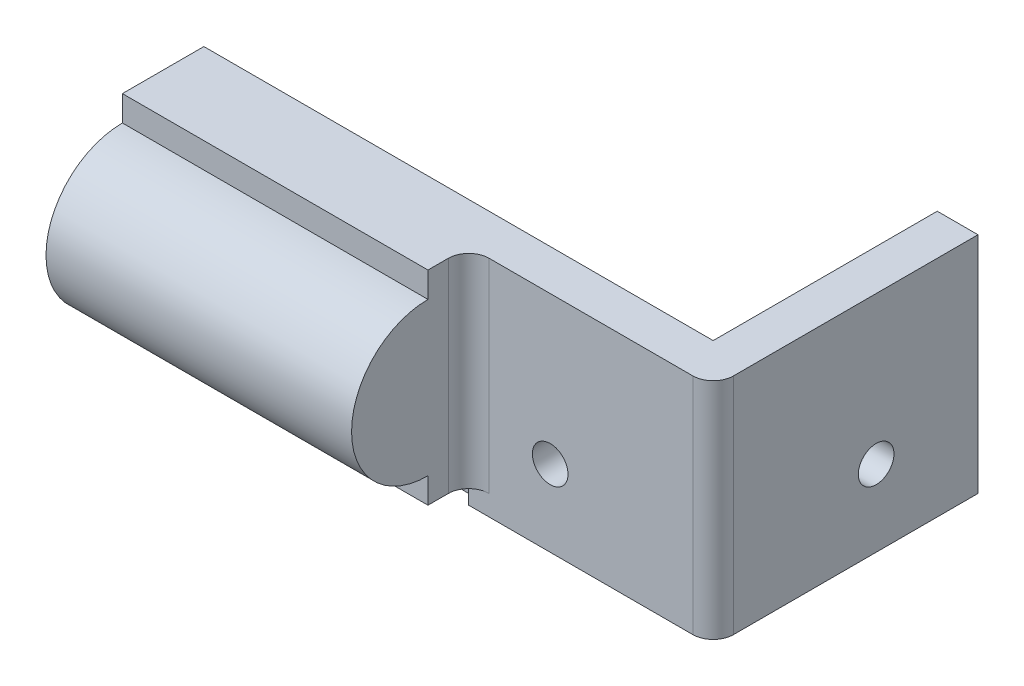
ISO-10303-21;
HEADER;
FILE_DESCRIPTION(('STEP AP214'),'2;1');
FILE_NAME('part.step','',(''),(''),'','','');
FILE_SCHEMA(('AUTOMOTIVE_DESIGN { 1 0 10303 214 1 1 1 1 }'));
ENDSEC;
DATA;
#1=APPLICATION_CONTEXT('core data for automotive mechanical design processes');
#2=APPLICATION_PROTOCOL_DEFINITION('international standard','automotive_design',2000,#1);
#3=PRODUCT_CONTEXT('',#1,'mechanical');
#4=PRODUCT('Part','Part','',(#3));
#5=PRODUCT_RELATED_PRODUCT_CATEGORY('part','',(#4));
#6=PRODUCT_DEFINITION_FORMATION('','',#4);
#7=PRODUCT_DEFINITION_CONTEXT('part definition',#1,'design');
#8=PRODUCT_DEFINITION('design','',#6,#7);
#9=PRODUCT_DEFINITION_SHAPE('','',#8);
#10=(LENGTH_UNIT() NAMED_UNIT(*) SI_UNIT(.MILLI.,.METRE.));
#11=(NAMED_UNIT(*) PLANE_ANGLE_UNIT() SI_UNIT($,.RADIAN.));
#12=(NAMED_UNIT(*) SI_UNIT($,.STERADIAN.) SOLID_ANGLE_UNIT());
#13=UNCERTAINTY_MEASURE_WITH_UNIT(LENGTH_MEASURE(1.E-05),#10,'distance_accuracy_value','');
#14=(GEOMETRIC_REPRESENTATION_CONTEXT(3) GLOBAL_UNCERTAINTY_ASSIGNED_CONTEXT((#13)) GLOBAL_UNIT_ASSIGNED_CONTEXT((#10,
#11,#12)) REPRESENTATION_CONTEXT('',''));
#15=CARTESIAN_POINT('',(0.,0.,0.));
#16=DIRECTION('',(0.,0.,1.));
#17=DIRECTION('',(1.,0.,0.));
#18=AXIS2_PLACEMENT_3D('',#15,#16,#17);
#19=CARTESIAN_POINT('',(0.,0.,3.));
#20=DIRECTION('',(0.,0.,-1.));
#21=DIRECTION('',(-1.,0.,0.));
#22=AXIS2_PLACEMENT_3D('',#19,#20,#21);
#23=PLANE('',#22);
#24=DIRECTION('',(0.,-1.,0.));
#25=VECTOR('',#24,1.);
#26=CARTESIAN_POINT('',(30.,22.,3.));
#27=LINE('',#26,#25);
#28=CARTESIAN_POINT('',(30.,2.,3.));
#29=VERTEX_POINT('',#28);
#30=CARTESIAN_POINT('',(30.,0.,3.));
#31=VERTEX_POINT('',#30);
#32=EDGE_CURVE('E172',#29,#31,#27,.T.);
#33=ORIENTED_EDGE('',*,*,#32,.F.);
#34=DIRECTION('',(1.,0.,0.));
#35=VECTOR('',#34,1.);
#36=CARTESIAN_POINT('',(0.,2.,3.));
#37=LINE('',#36,#35);
#38=CARTESIAN_POINT('',(0.,2.,3.));
#39=VERTEX_POINT('',#38);
#40=EDGE_CURVE('E214',#39,#29,#37,.T.);
#41=ORIENTED_EDGE('',*,*,#40,.F.);
#42=DIRECTION('',(0.,-1.,0.));
#43=VECTOR('',#42,1.);
#44=CARTESIAN_POINT('',(0.,0.,3.));
#45=LINE('',#44,#43);
#46=CARTESIAN_POINT('',(0.,0.,3.));
#47=VERTEX_POINT('',#46);
#48=EDGE_CURVE('E245',#39,#47,#45,.T.);
#49=ORIENTED_EDGE('',*,*,#48,.T.);
#50=DIRECTION('',(1.,0.,0.));
#51=VECTOR('',#50,1.);
#52=CARTESIAN_POINT('',(0.,0.,3.));
#53=LINE('',#52,#51);
#54=EDGE_CURVE('E247',#47,#31,#53,.T.);
#55=ORIENTED_EDGE('',*,*,#54,.T.);
#56=EDGE_LOOP('',(#33,#41,#49,#55));
#57=FACE_BOUND('',#56,.T.);
#58=ADVANCED_FACE('F35',(#57),#23,.F.);
#59=CARTESIAN_POINT('',(30.,2.,8.));
#60=DIRECTION('',(-1.,0.,0.));
#61=DIRECTION('',(0.,0.,1.));
#62=AXIS2_PLACEMENT_3D('',#59,#60,#61);
#63=PLANE('',#62);
#64=DIRECTION('',(0.,0.,-1.));
#65=VECTOR('',#64,1.);
#66=CARTESIAN_POINT('',(30.,2.,8.));
#67=LINE('',#66,#65);
#68=CARTESIAN_POINT('',(30.,2.,8.));
#69=VERTEX_POINT('',#68);
#70=CARTESIAN_POINT('',(30.,2.,6.));
#71=VERTEX_POINT('',#70);
#72=EDGE_CURVE('E235',#69,#71,#67,.T.);
#73=ORIENTED_EDGE('',*,*,#72,.T.);
#74=DIRECTION('',(0.,-1.,0.));
#75=VECTOR('',#74,1.);
#76=CARTESIAN_POINT('',(30.,22.,6.));
#77=LINE('',#76,#75);
#78=CARTESIAN_POINT('',(30.,22.,6.));
#79=VERTEX_POINT('',#78);
#80=EDGE_CURVE('E268',#71,#79,#77,.F.);
#81=ORIENTED_EDGE('',*,*,#80,.T.);
#82=DIRECTION('',(0.,0.,-1.));
#83=VECTOR('',#82,1.);
#84=CARTESIAN_POINT('',(30.,22.,8.));
#85=LINE('',#84,#83);
#86=CARTESIAN_POINT('',(30.,22.,8.));
#87=VERTEX_POINT('',#86);
#88=EDGE_CURVE('E232',#87,#79,#85,.T.);
#89=ORIENTED_EDGE('',*,*,#88,.F.);
#90=DIRECTION('',(0.,1.,0.));
#91=VECTOR('',#90,1.);
#92=CARTESIAN_POINT('',(30.,2.,8.));
#93=LINE('',#92,#91);
#94=CARTESIAN_POINT('',(30.,19.5,8.));
#95=VERTEX_POINT('',#94);
#96=EDGE_CURVE('E222',#95,#87,#93,.T.);
#97=ORIENTED_EDGE('',*,*,#96,.F.);
#98=CARTESIAN_POINT('',(30.,12.,8.));
#99=DIRECTION('',(-1.,0.,0.));
#100=DIRECTION('',(0.,0.,1.));
#101=AXIS2_PLACEMENT_3D('',#98,#99,#100);
#102=CIRCLE('',#101,7.5);
#103=CARTESIAN_POINT('',(30.,4.5,8.));
#104=VERTEX_POINT('',#103);
#105=EDGE_CURVE('E205',#104,#95,#102,.T.);
#106=ORIENTED_EDGE('',*,*,#105,.F.);
#107=EDGE_CURVE('E223',#69,#104,#93,.T.);
#108=ORIENTED_EDGE('',*,*,#107,.F.);
#109=EDGE_LOOP('',(#73,#81,#89,#97,#106,#108));
#110=FACE_BOUND('',#109,.T.);
#111=ADVANCED_FACE('F284',(#110),#63,.F.);
#112=CARTESIAN_POINT('',(0.,0.,8.));
#113=DIRECTION('',(0.,0.,-1.));
#114=DIRECTION('',(-1.,0.,0.));
#115=AXIS2_PLACEMENT_3D('',#112,#113,#114);
#116=PLANE('',#115);
#117=ORIENTED_EDGE('',*,*,#107,.T.);
#118=DIRECTION('',(-1.,0.,0.));
#119=VECTOR('',#118,1.);
#120=CARTESIAN_POINT('',(30.,4.5,8.));
#121=LINE('',#120,#119);
#122=CARTESIAN_POINT('',(0.,4.5,8.));
#123=VERTEX_POINT('',#122);
#124=EDGE_CURVE('E211',#104,#123,#121,.T.);
#125=ORIENTED_EDGE('',*,*,#124,.T.);
#126=DIRECTION('',(0.,-1.,0.));
#127=VECTOR('',#126,1.);
#128=CARTESIAN_POINT('',(0.,2.,8.));
#129=LINE('',#128,#127);
#130=CARTESIAN_POINT('',(0.,2.,8.));
#131=VERTEX_POINT('',#130);
#132=EDGE_CURVE('E220',#123,#131,#129,.T.);
#133=ORIENTED_EDGE('',*,*,#132,.T.);
#134=DIRECTION('',(1.,0.,0.));
#135=VECTOR('',#134,1.);
#136=CARTESIAN_POINT('',(0.,2.,8.));
#137=LINE('',#136,#135);
#138=EDGE_CURVE('E219',#131,#69,#137,.T.);
#139=ORIENTED_EDGE('',*,*,#138,.T.);
#140=EDGE_LOOP('',(#117,#125,#133,#139));
#141=FACE_BOUND('',#140,.T.);
#142=ADVANCED_FACE('F314',(#141),#116,.F.);
#143=CARTESIAN_POINT('',(0.,0.,3.));
#144=DIRECTION('',(1.,0.,0.));
#145=DIRECTION('',(0.,0.,-1.));
#146=AXIS2_PLACEMENT_3D('',#143,#144,#145);
#147=PLANE('',#146);
#148=CARTESIAN_POINT('',(0.,12.,8.));
#149=DIRECTION('',(-1.,0.,0.));
#150=DIRECTION('',(0.,0.,1.));
#151=AXIS2_PLACEMENT_3D('',#148,#149,#150);
#152=CIRCLE('',#151,4.);
#153=CARTESIAN_POINT('',(0.,12.,12.));
#154=VERTEX_POINT('',#153);
#155=EDGE_CURVE('E198',#154,#154,#152,.T.);
#156=ORIENTED_EDGE('',*,*,#155,.F.);
#157=EDGE_LOOP('',(#156));
#158=FACE_BOUND('',#157,.T.);
#159=DIRECTION('',(0.,0.,-1.));
#160=VECTOR('',#159,1.);
#161=CARTESIAN_POINT('',(0.,22.,8.));
#162=LINE('',#161,#160);
#163=CARTESIAN_POINT('',(0.,22.,8.));
#164=VERTEX_POINT('',#163);
#165=CARTESIAN_POINT('',(0.,22.,0.));
#166=VERTEX_POINT('',#165);
#167=EDGE_CURVE('E227',#164,#166,#162,.T.);
#168=ORIENTED_EDGE('',*,*,#167,.T.);
#169=DIRECTION('',(0.,-1.,0.));
#170=VECTOR('',#169,1.);
#171=CARTESIAN_POINT('',(0.,0.,0.));
#172=LINE('',#171,#170);
#173=CARTESIAN_POINT('',(0.,0.,0.));
#174=VERTEX_POINT('',#173);
#175=EDGE_CURVE('E244',#166,#174,#172,.T.);
#176=ORIENTED_EDGE('',*,*,#175,.T.);
#177=DIRECTION('',(0.,0.,-1.));
#178=VECTOR('',#177,1.);
#179=CARTESIAN_POINT('',(0.,0.,3.));
#180=LINE('',#179,#178);
#181=EDGE_CURVE('E251',#47,#174,#180,.T.);
#182=ORIENTED_EDGE('',*,*,#181,.F.);
#183=ORIENTED_EDGE('',*,*,#48,.F.);
#184=DIRECTION('',(0.,0.,-1.));
#185=VECTOR('',#184,1.);
#186=CARTESIAN_POINT('',(0.,2.,8.));
#187=LINE('',#186,#185);
#188=EDGE_CURVE('E238',#131,#39,#187,.T.);
#189=ORIENTED_EDGE('',*,*,#188,.F.);
#190=ORIENTED_EDGE('',*,*,#132,.F.);
#191=CARTESIAN_POINT('',(0.,12.,8.));
#192=DIRECTION('',(-1.,0.,0.));
#193=DIRECTION('',(0.,0.,1.));
#194=AXIS2_PLACEMENT_3D('',#191,#192,#193);
#195=CIRCLE('',#194,7.5);
#196=CARTESIAN_POINT('',(0.,19.5,8.));
#197=VERTEX_POINT('',#196);
#198=EDGE_CURVE('E202',#123,#197,#195,.T.);
#199=ORIENTED_EDGE('',*,*,#198,.T.);
#200=EDGE_CURVE('E217',#164,#197,#129,.T.);
#201=ORIENTED_EDGE('',*,*,#200,.F.);
#202=EDGE_LOOP('',(#168,#176,#182,#183,#189,#190,#199,#201));
#203=FACE_BOUND('',#202,.T.);
#204=ADVANCED_FACE('F305',(#158,#203),#147,.F.);
#205=CARTESIAN_POINT('',(0.,0.,3.));
#206=DIRECTION('',(0.,1.,0.));
#207=DIRECTION('',(0.,0.,1.));
#208=AXIS2_PLACEMENT_3D('',#205,#206,#207);
#209=PLANE('',#208);
#210=DIRECTION('',(0.,0.,-1.));
#211=VECTOR('',#210,1.);
#212=CARTESIAN_POINT('',(54.,0.,-22.));
#213=LINE('',#212,#211);
#214=CARTESIAN_POINT('',(54.,0.,1.99999999999999));
#215=VERTEX_POINT('',#214);
#216=CARTESIAN_POINT('',(54.,0.,-22.));
#217=VERTEX_POINT('',#216);
#218=EDGE_CURVE('E157',#215,#217,#213,.T.);
#219=ORIENTED_EDGE('',*,*,#218,.F.);
#220=CARTESIAN_POINT('',(52.,0.,2.));
#221=DIRECTION('',(0.,1.,0.));
#222=DIRECTION('',(0.,0.,1.));
#223=AXIS2_PLACEMENT_3D('',#220,#221,#222);
#224=CIRCLE('',#223,2.);
#225=CARTESIAN_POINT('',(52.,0.,4.));
#226=VERTEX_POINT('',#225);
#227=EDGE_CURVE('E50',#215,#226,#224,.F.);
#228=ORIENTED_EDGE('',*,*,#227,.T.);
#229=DIRECTION('',(1.,0.,0.));
#230=VECTOR('',#229,1.);
#231=CARTESIAN_POINT('',(53.,0.,4.));
#232=LINE('',#231,#230);
#233=CARTESIAN_POINT('',(30.,0.,4.));
#234=VERTEX_POINT('',#233);
#235=EDGE_CURVE('E178',#234,#226,#232,.T.);
#236=ORIENTED_EDGE('',*,*,#235,.F.);
#237=DIRECTION('',(0.,0.,-1.));
#238=VECTOR('',#237,1.);
#239=CARTESIAN_POINT('',(30.,0.,4.));
#240=LINE('',#239,#238);
#241=EDGE_CURVE('E181',#234,#31,#240,.T.);
#242=ORIENTED_EDGE('',*,*,#241,.T.);
#243=ORIENTED_EDGE('',*,*,#54,.F.);
#244=ORIENTED_EDGE('',*,*,#181,.T.);
#245=DIRECTION('',(1.,0.,0.));
#246=VECTOR('',#245,1.);
#247=CARTESIAN_POINT('',(0.,0.,0.));
#248=LINE('',#247,#246);
#249=CARTESIAN_POINT('',(50.,0.,0.));
#250=VERTEX_POINT('',#249);
#251=EDGE_CURVE('E248',#174,#250,#248,.T.);
#252=ORIENTED_EDGE('',*,*,#251,.T.);
#253=DIRECTION('',(0.,0.,1.));
#254=VECTOR('',#253,1.);
#255=CARTESIAN_POINT('',(50.,0.,-22.));
#256=LINE('',#255,#254);
#257=CARTESIAN_POINT('',(50.,0.,-22.));
#258=VERTEX_POINT('',#257);
#259=EDGE_CURVE('E195',#258,#250,#256,.T.);
#260=ORIENTED_EDGE('',*,*,#259,.F.);
#261=DIRECTION('',(-1.,0.,0.));
#262=VECTOR('',#261,1.);
#263=CARTESIAN_POINT('',(53.,0.,-22.));
#264=LINE('',#263,#262);
#265=EDGE_CURVE('E188',#217,#258,#264,.T.);
#266=ORIENTED_EDGE('',*,*,#265,.F.);
#267=EDGE_LOOP('',(#219,#228,#236,#242,#243,#244,#252,#260,#266));
#268=FACE_BOUND('',#267,.T.);
#269=ADVANCED_FACE('F295',(#268),#209,.F.);
#270=CARTESIAN_POINT('',(0.,0.,0.));
#271=DIRECTION('',(0.,0.,-1.));
#272=DIRECTION('',(-1.,0.,0.));
#273=AXIS2_PLACEMENT_3D('',#270,#271,#272);
#274=PLANE('',#273);
#275=DIRECTION('',(0.,1.,0.));
#276=VECTOR('',#275,1.);
#277=CARTESIAN_POINT('',(50.,0.,0.));
#278=LINE('',#277,#276);
#279=CARTESIAN_POINT('',(50.,22.,0.));
#280=VERTEX_POINT('',#279);
#281=EDGE_CURVE('E190',#250,#280,#278,.T.);
#282=ORIENTED_EDGE('',*,*,#281,.F.);
#283=ORIENTED_EDGE('',*,*,#251,.F.);
#284=ORIENTED_EDGE('',*,*,#175,.F.);
#285=DIRECTION('',(-1.,0.,0.));
#286=VECTOR('',#285,1.);
#287=CARTESIAN_POINT('',(0.,22.,0.));
#288=LINE('',#287,#286);
#289=EDGE_CURVE('E257',#280,#166,#288,.T.);
#290=ORIENTED_EDGE('',*,*,#289,.F.);
#291=EDGE_LOOP('',(#282,#283,#284,#290));
#292=FACE_BOUND('',#291,.T.);
#293=CARTESIAN_POINT('',(38.,7.5,0.));
#294=DIRECTION('',(0.,0.,1.));
#295=DIRECTION('',(1.,0.,0.));
#296=AXIS2_PLACEMENT_3D('',#293,#294,#295);
#297=CIRCLE('',#296,1.75);
#298=CARTESIAN_POINT('',(39.75,7.5,0.));
#299=VERTEX_POINT('',#298);
#300=EDGE_CURVE('E241',#299,#299,#297,.T.);
#301=ORIENTED_EDGE('',*,*,#300,.T.);
#302=EDGE_LOOP('',(#301));
#303=FACE_BOUND('',#302,.T.);
#304=ADVANCED_FACE('F307',(#292,#303),#274,.T.);
#305=CARTESIAN_POINT('',(38.,7.5,0.));
#306=DIRECTION('',(0.,0.,1.));
#307=DIRECTION('',(1.,0.,0.));
#308=AXIS2_PLACEMENT_3D('',#305,#306,#307);
#309=CYLINDRICAL_SURFACE('',#308,1.75);
#310=ORIENTED_EDGE('',*,*,#300,.F.);
#311=EDGE_LOOP('',(#310));
#312=FACE_BOUND('',#311,.T.);
#313=CARTESIAN_POINT('',(38.,7.5,4.));
#314=DIRECTION('',(0.,0.,1.));
#315=DIRECTION('',(1.,0.,0.));
#316=AXIS2_PLACEMENT_3D('',#313,#314,#315);
#317=CIRCLE('',#316,1.75);
#318=CARTESIAN_POINT('',(39.75,7.5,4.));
#319=VERTEX_POINT('',#318);
#320=EDGE_CURVE('E169',#319,#319,#317,.T.);
#321=ORIENTED_EDGE('',*,*,#320,.T.);
#322=EDGE_LOOP('',(#321));
#323=FACE_BOUND('',#322,.T.);
#324=ADVANCED_FACE('F344',(#312,#323),#309,.F.);
#325=CARTESIAN_POINT('',(0.,2.,8.));
#326=DIRECTION('',(0.,1.,0.));
#327=DIRECTION('',(0.,0.,1.));
#328=AXIS2_PLACEMENT_3D('',#325,#326,#327);
#329=PLANE('',#328);
#330=ORIENTED_EDGE('',*,*,#40,.T.);
#331=DIRECTION('',(0.,0.,-1.));
#332=VECTOR('',#331,1.);
#333=CARTESIAN_POINT('',(30.,2.,8.));
#334=LINE('',#333,#332);
#335=CARTESIAN_POINT('',(30.,2.,4.));
#336=VERTEX_POINT('',#335);
#337=EDGE_CURVE('E185',#336,#29,#334,.T.);
#338=ORIENTED_EDGE('',*,*,#337,.F.);
#339=DIRECTION('',(-1.,0.,0.));
#340=VECTOR('',#339,1.);
#341=CARTESIAN_POINT('',(0.,2.,4.));
#342=LINE('',#341,#340);
#343=CARTESIAN_POINT('',(32.,2.,4.));
#344=VERTEX_POINT('',#343);
#345=EDGE_CURVE('E263',#344,#336,#342,.T.);
#346=ORIENTED_EDGE('',*,*,#345,.F.);
#347=CARTESIAN_POINT('',(32.,2.,6.));
#348=DIRECTION('',(0.,1.,0.));
#349=DIRECTION('',(0.,0.,1.));
#350=AXIS2_PLACEMENT_3D('',#347,#348,#349);
#351=CIRCLE('',#350,2.);
#352=EDGE_CURVE('E43',#344,#71,#351,.T.);
#353=ORIENTED_EDGE('',*,*,#352,.T.);
#354=ORIENTED_EDGE('',*,*,#72,.F.);
#355=ORIENTED_EDGE('',*,*,#138,.F.);
#356=ORIENTED_EDGE('',*,*,#188,.T.);
#357=EDGE_LOOP('',(#330,#338,#346,#353,#354,#355,#356));
#358=FACE_BOUND('',#357,.T.);
#359=ADVANCED_FACE('F276',(#358),#329,.F.);
#360=CARTESIAN_POINT('',(0.,22.,8.));
#361=DIRECTION('',(0.,-1.,0.));
#362=DIRECTION('',(0.,0.,-1.));
#363=AXIS2_PLACEMENT_3D('',#360,#361,#362);
#364=PLANE('',#363);
#365=DIRECTION('',(-1.,0.,0.));
#366=VECTOR('',#365,1.);
#367=CARTESIAN_POINT('',(53.,22.,4.));
#368=LINE('',#367,#366);
#369=CARTESIAN_POINT('',(52.,22.,4.));
#370=VERTEX_POINT('',#369);
#371=CARTESIAN_POINT('',(32.,22.,4.));
#372=VERTEX_POINT('',#371);
#373=EDGE_CURVE('E173',#370,#372,#368,.T.);
#374=ORIENTED_EDGE('',*,*,#373,.F.);
#375=CARTESIAN_POINT('',(52.,22.,2.));
#376=DIRECTION('',(0.,-1.,0.));
#377=DIRECTION('',(0.,0.,-1.));
#378=AXIS2_PLACEMENT_3D('',#375,#376,#377);
#379=CIRCLE('',#378,2.);
#380=CARTESIAN_POINT('',(54.,22.,1.99999999999999));
#381=VERTEX_POINT('',#380);
#382=EDGE_CURVE('E58',#370,#381,#379,.F.);
#383=ORIENTED_EDGE('',*,*,#382,.T.);
#384=DIRECTION('',(0.,0.,1.));
#385=VECTOR('',#384,1.);
#386=CARTESIAN_POINT('',(54.,22.,-22.));
#387=LINE('',#386,#385);
#388=CARTESIAN_POINT('',(54.,22.,-22.));
#389=VERTEX_POINT('',#388);
#390=EDGE_CURVE('E154',#389,#381,#387,.T.);
#391=ORIENTED_EDGE('',*,*,#390,.F.);
#392=DIRECTION('',(1.,0.,0.));
#393=VECTOR('',#392,1.);
#394=CARTESIAN_POINT('',(53.,22.,-22.));
#395=LINE('',#394,#393);
#396=CARTESIAN_POINT('',(50.,22.,-22.));
#397=VERTEX_POINT('',#396);
#398=EDGE_CURVE('E144',#397,#389,#395,.T.);
#399=ORIENTED_EDGE('',*,*,#398,.F.);
#400=DIRECTION('',(0.,0.,1.));
#401=VECTOR('',#400,1.);
#402=CARTESIAN_POINT('',(50.,22.,-22.));
#403=LINE('',#402,#401);
#404=EDGE_CURVE('E152',#397,#280,#403,.T.);
#405=ORIENTED_EDGE('',*,*,#404,.T.);
#406=ORIENTED_EDGE('',*,*,#289,.T.);
#407=ORIENTED_EDGE('',*,*,#167,.F.);
#408=DIRECTION('',(-1.,0.,0.));
#409=VECTOR('',#408,1.);
#410=CARTESIAN_POINT('',(0.,22.,8.));
#411=LINE('',#410,#409);
#412=EDGE_CURVE('E225',#87,#164,#411,.T.);
#413=ORIENTED_EDGE('',*,*,#412,.F.);
#414=ORIENTED_EDGE('',*,*,#88,.T.);
#415=CARTESIAN_POINT('',(32.,22.,6.));
#416=DIRECTION('',(0.,-1.,0.));
#417=DIRECTION('',(0.,0.,-1.));
#418=AXIS2_PLACEMENT_3D('',#415,#416,#417);
#419=CIRCLE('',#418,2.);
#420=EDGE_CURVE('E11',#79,#372,#419,.T.);
#421=ORIENTED_EDGE('',*,*,#420,.T.);
#422=EDGE_LOOP('',(#374,#383,#391,#399,#405,#406,#407,#413,#414,#421));
#423=FACE_BOUND('',#422,.T.);
#424=ADVANCED_FACE('F155',(#423),#364,.F.);
#425=ORIENTED_EDGE('',*,*,#200,.T.);
#426=DIRECTION('',(-1.,0.,0.));
#427=VECTOR('',#426,1.);
#428=CARTESIAN_POINT('',(30.,19.5,8.));
#429=LINE('',#428,#427);
#430=EDGE_CURVE('E208',#95,#197,#429,.T.);
#431=ORIENTED_EDGE('',*,*,#430,.F.);
#432=ORIENTED_EDGE('',*,*,#96,.T.);
#433=ORIENTED_EDGE('',*,*,#412,.T.);
#434=EDGE_LOOP('',(#425,#431,#432,#433));
#435=FACE_BOUND('',#434,.T.);
#436=ADVANCED_FACE('F321',(#435),#116,.F.);
#437=CARTESIAN_POINT('',(30.,12.,8.));
#438=DIRECTION('',(-1.,0.,0.));
#439=DIRECTION('',(0.,0.,1.));
#440=AXIS2_PLACEMENT_3D('',#437,#438,#439);
#441=CYLINDRICAL_SURFACE('',#440,7.5);
#442=ORIENTED_EDGE('',*,*,#198,.F.);
#443=ORIENTED_EDGE('',*,*,#124,.F.);
#444=ORIENTED_EDGE('',*,*,#105,.T.);
#445=ORIENTED_EDGE('',*,*,#430,.T.);
#446=EDGE_LOOP('',(#442,#443,#444,#445));
#447=FACE_BOUND('',#446,.T.);
#448=ADVANCED_FACE('F318',(#447),#441,.T.);
#449=CARTESIAN_POINT('',(20.,12.,8.));
#450=DIRECTION('',(-1.,0.,0.));
#451=DIRECTION('',(0.,0.,1.));
#452=AXIS2_PLACEMENT_3D('',#449,#450,#451);
#453=CYLINDRICAL_SURFACE('',#452,4.);
#454=CARTESIAN_POINT('',(20.,12.,8.));
#455=DIRECTION('',(-1.,0.,0.));
#456=DIRECTION('',(0.,0.,1.));
#457=AXIS2_PLACEMENT_3D('',#454,#455,#456);
#458=CIRCLE('',#457,4.);
#459=CARTESIAN_POINT('',(20.,12.,12.));
#460=VERTEX_POINT('',#459);
#461=EDGE_CURVE('E199',#460,#460,#458,.T.);
#462=ORIENTED_EDGE('',*,*,#461,.F.);
#463=EDGE_LOOP('',(#462));
#464=FACE_BOUND('',#463,.T.);
#465=ORIENTED_EDGE('',*,*,#155,.T.);
#466=EDGE_LOOP('',(#465));
#467=FACE_BOUND('',#466,.T.);
#468=ADVANCED_FACE('F328',(#464,#467),#453,.F.);
#469=CARTESIAN_POINT('',(20.,12.,8.));
#470=DIRECTION('',(-1.,0.,0.));
#471=DIRECTION('',(0.,0.,1.));
#472=AXIS2_PLACEMENT_3D('',#469,#470,#471);
#473=PLANE('',#472);
#474=ORIENTED_EDGE('',*,*,#461,.T.);
#475=EDGE_LOOP('',(#474));
#476=FACE_BOUND('',#475,.T.);
#477=ADVANCED_FACE('F375',(#476),#473,.T.);
#478=CARTESIAN_POINT('',(50.,0.,-22.));
#479=DIRECTION('',(1.,0.,0.));
#480=DIRECTION('',(0.,0.,-1.));
#481=AXIS2_PLACEMENT_3D('',#478,#479,#480);
#482=PLANE('',#481);
#483=CARTESIAN_POINT('',(50.,7.5,-12.));
#484=DIRECTION('',(1.,0.,0.));
#485=DIRECTION('',(0.,0.,-1.));
#486=AXIS2_PLACEMENT_3D('',#483,#484,#485);
#487=CIRCLE('',#486,1.75);
#488=CARTESIAN_POINT('',(50.,7.5,-13.75));
#489=VERTEX_POINT('',#488);
#490=EDGE_CURVE('E187',#489,#489,#487,.T.);
#491=ORIENTED_EDGE('',*,*,#490,.T.);
#492=EDGE_LOOP('',(#491));
#493=FACE_BOUND('',#492,.T.);
#494=ORIENTED_EDGE('',*,*,#281,.T.);
#495=ORIENTED_EDGE('',*,*,#404,.F.);
#496=DIRECTION('',(0.,1.,0.));
#497=VECTOR('',#496,1.);
#498=CARTESIAN_POINT('',(50.,0.,-22.));
#499=LINE('',#498,#497);
#500=EDGE_CURVE('E149',#258,#397,#499,.T.);
#501=ORIENTED_EDGE('',*,*,#500,.F.);
#502=ORIENTED_EDGE('',*,*,#259,.T.);
#503=EDGE_LOOP('',(#494,#495,#501,#502));
#504=FACE_BOUND('',#503,.T.);
#505=ADVANCED_FACE('F299',(#493,#504),#482,.F.);
#506=CARTESIAN_POINT('',(0.,0.,-22.));
#507=DIRECTION('',(0.,0.,1.));
#508=DIRECTION('',(1.,0.,0.));
#509=AXIS2_PLACEMENT_3D('',#506,#507,#508);
#510=PLANE('',#509);
#511=ORIENTED_EDGE('',*,*,#398,.T.);
#512=DIRECTION('',(0.,1.,0.));
#513=VECTOR('',#512,1.);
#514=CARTESIAN_POINT('',(54.,0.,-22.));
#515=LINE('',#514,#513);
#516=EDGE_CURVE('E147',#217,#389,#515,.T.);
#517=ORIENTED_EDGE('',*,*,#516,.F.);
#518=ORIENTED_EDGE('',*,*,#265,.T.);
#519=ORIENTED_EDGE('',*,*,#500,.T.);
#520=EDGE_LOOP('',(#511,#517,#518,#519));
#521=FACE_BOUND('',#520,.T.);
#522=ADVANCED_FACE('F145',(#521),#510,.F.);
#523=CARTESIAN_POINT('',(0.,7.5,-12.));
#524=DIRECTION('',(1.,0.,0.));
#525=DIRECTION('',(0.,0.,-1.));
#526=AXIS2_PLACEMENT_3D('',#523,#524,#525);
#527=CYLINDRICAL_SURFACE('',#526,1.75);
#528=ORIENTED_EDGE('',*,*,#490,.F.);
#529=EDGE_LOOP('',(#528));
#530=FACE_BOUND('',#529,.T.);
#531=CARTESIAN_POINT('',(54.,7.5,-12.));
#532=DIRECTION('',(1.,0.,0.));
#533=DIRECTION('',(0.,0.,-1.));
#534=AXIS2_PLACEMENT_3D('',#531,#532,#533);
#535=CIRCLE('',#534,1.75);
#536=CARTESIAN_POINT('',(54.,7.5,-13.75));
#537=VERTEX_POINT('',#536);
#538=EDGE_CURVE('E163',#537,#537,#535,.T.);
#539=ORIENTED_EDGE('',*,*,#538,.T.);
#540=EDGE_LOOP('',(#539));
#541=FACE_BOUND('',#540,.T.);
#542=ADVANCED_FACE('F366',(#530,#541),#527,.F.);
#543=CARTESIAN_POINT('',(30.,22.,4.));
#544=DIRECTION('',(1.,0.,0.));
#545=DIRECTION('',(0.,0.,-1.));
#546=AXIS2_PLACEMENT_3D('',#543,#544,#545);
#547=PLANE('',#546);
#548=DIRECTION('',(0.,-1.,0.));
#549=VECTOR('',#548,1.);
#550=CARTESIAN_POINT('',(30.,22.,4.));
#551=LINE('',#550,#549);
#552=EDGE_CURVE('E176',#336,#234,#551,.T.);
#553=ORIENTED_EDGE('',*,*,#552,.F.);
#554=ORIENTED_EDGE('',*,*,#337,.T.);
#555=ORIENTED_EDGE('',*,*,#32,.T.);
#556=ORIENTED_EDGE('',*,*,#241,.F.);
#557=EDGE_LOOP('',(#553,#554,#555,#556));
#558=FACE_BOUND('',#557,.T.);
#559=ADVANCED_FACE('F361',(#558),#547,.F.);
#560=CARTESIAN_POINT('',(0.,0.,4.));
#561=DIRECTION('',(0.,0.,-1.));
#562=DIRECTION('',(-1.,0.,0.));
#563=AXIS2_PLACEMENT_3D('',#560,#561,#562);
#564=PLANE('',#563);
#565=ORIENTED_EDGE('',*,*,#373,.T.);
#566=DIRECTION('',(0.,-1.,0.));
#567=VECTOR('',#566,1.);
#568=CARTESIAN_POINT('',(32.,2.,4.));
#569=LINE('',#568,#567);
#570=EDGE_CURVE('E265',#372,#344,#569,.T.);
#571=ORIENTED_EDGE('',*,*,#570,.T.);
#572=ORIENTED_EDGE('',*,*,#345,.T.);
#573=ORIENTED_EDGE('',*,*,#552,.T.);
#574=ORIENTED_EDGE('',*,*,#235,.T.);
#575=DIRECTION('',(0.,-1.,0.));
#576=VECTOR('',#575,1.);
#577=CARTESIAN_POINT('',(52.,22.,4.));
#578=LINE('',#577,#576);
#579=EDGE_CURVE('E259',#226,#370,#578,.F.);
#580=ORIENTED_EDGE('',*,*,#579,.T.);
#581=EDGE_LOOP('',(#565,#571,#572,#573,#574,#580));
#582=FACE_BOUND('',#581,.T.);
#583=ORIENTED_EDGE('',*,*,#320,.F.);
#584=EDGE_LOOP('',(#583));
#585=FACE_BOUND('',#584,.T.);
#586=ADVANCED_FACE('F291',(#582,#585),#564,.F.);
#587=CARTESIAN_POINT('',(54.,0.,0.));
#588=DIRECTION('',(1.,0.,0.));
#589=DIRECTION('',(0.,0.,-1.));
#590=AXIS2_PLACEMENT_3D('',#587,#588,#589);
#591=PLANE('',#590);
#592=ORIENTED_EDGE('',*,*,#390,.T.);
#593=DIRECTION('',(0.,-1.,0.));
#594=VECTOR('',#593,1.);
#595=CARTESIAN_POINT('',(54.,0.,2.));
#596=LINE('',#595,#594);
#597=EDGE_CURVE('E270',#381,#215,#596,.T.);
#598=ORIENTED_EDGE('',*,*,#597,.T.);
#599=ORIENTED_EDGE('',*,*,#218,.T.);
#600=ORIENTED_EDGE('',*,*,#516,.T.);
#601=EDGE_LOOP('',(#592,#598,#599,#600));
#602=FACE_BOUND('',#601,.T.);
#603=ORIENTED_EDGE('',*,*,#538,.F.);
#604=EDGE_LOOP('',(#603));
#605=FACE_BOUND('',#604,.T.);
#606=ADVANCED_FACE('F159',(#602,#605),#591,.T.);
#607=CARTESIAN_POINT('',(32.,0.,6.));
#608=DIRECTION('',(0.,1.,0.));
#609=DIRECTION('',(0.,0.,1.));
#610=AXIS2_PLACEMENT_3D('',#607,#608,#609);
#611=CYLINDRICAL_SURFACE('',#610,2.);
#612=ORIENTED_EDGE('',*,*,#420,.F.);
#613=ORIENTED_EDGE('',*,*,#80,.F.);
#614=ORIENTED_EDGE('',*,*,#352,.F.);
#615=ORIENTED_EDGE('',*,*,#570,.F.);
#616=EDGE_LOOP('',(#612,#613,#614,#615));
#617=FACE_BOUND('',#616,.T.);
#618=ADVANCED_FACE('F288',(#617),#611,.F.);
#619=CARTESIAN_POINT('',(52.,0.,2.));
#620=DIRECTION('',(0.,1.,0.));
#621=DIRECTION('',(0.,0.,1.));
#622=AXIS2_PLACEMENT_3D('',#619,#620,#621);
#623=CYLINDRICAL_SURFACE('',#622,2.);
#624=ORIENTED_EDGE('',*,*,#382,.F.);
#625=ORIENTED_EDGE('',*,*,#579,.F.);
#626=ORIENTED_EDGE('',*,*,#227,.F.);
#627=ORIENTED_EDGE('',*,*,#597,.F.);
#628=EDGE_LOOP('',(#624,#625,#626,#627));
#629=FACE_BOUND('',#628,.T.);
#630=ADVANCED_FACE('F37',(#629),#623,.T.);
#631=CLOSED_SHELL('',(#58,#111,#142,#204,#269,#304,#324,#359,#424,#436,#448,#468,#477,#505,#522,
#542,#559,#586,#606,#618,#630));
#632=MANIFOLD_SOLID_BREP('B2',#631);
#633=ADVANCED_BREP_SHAPE_REPRESENTATION('',(#18,#632),#14);
#634=SHAPE_DEFINITION_REPRESENTATION(#9,#633);
ENDSEC;
END-ISO-10303-21;
